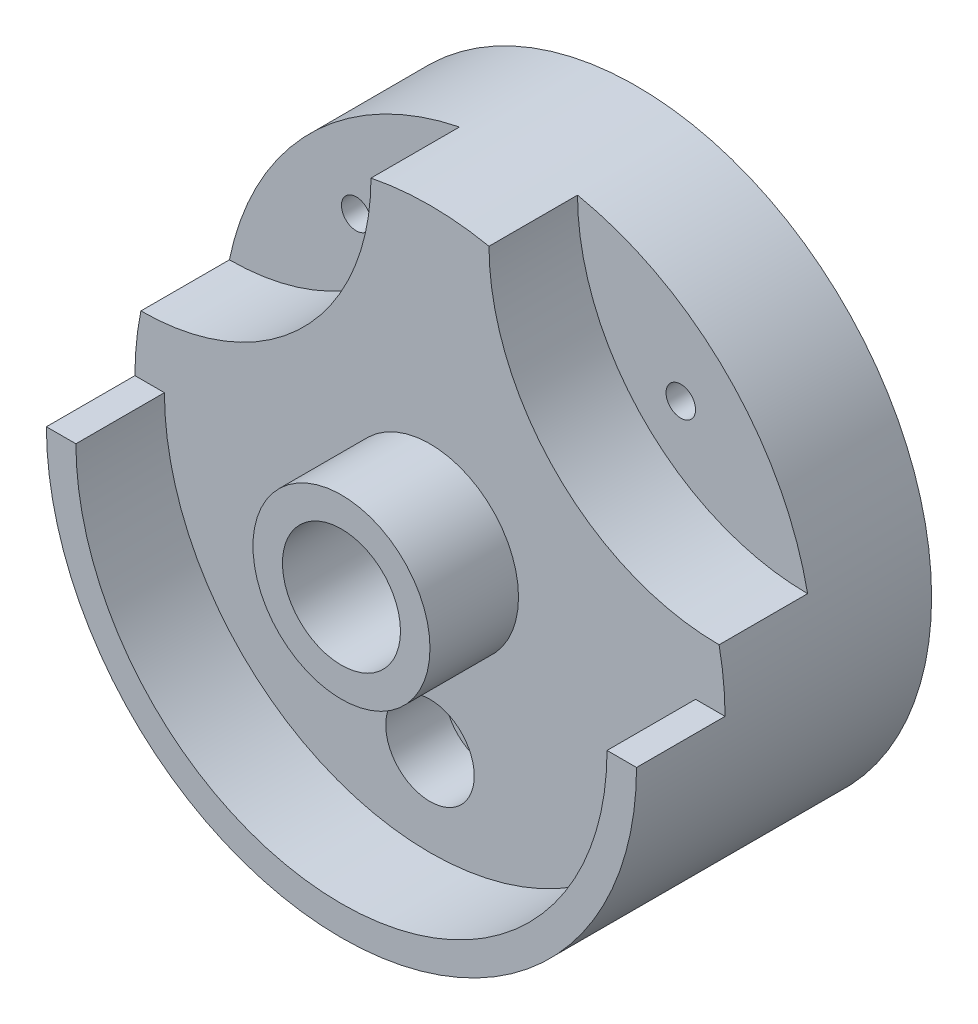
ISO-10303-21;
HEADER;
FILE_DESCRIPTION(('STEP AP214'),'2;1');
FILE_NAME('part.step','',(''),(''),'','','');
FILE_SCHEMA(('AUTOMOTIVE_DESIGN { 1 0 10303 214 1 1 1 1 }'));
ENDSEC;
DATA;
#1=APPLICATION_CONTEXT('core data for automotive mechanical design processes');
#2=APPLICATION_PROTOCOL_DEFINITION('international standard','automotive_design',2000,#1);
#3=PRODUCT_CONTEXT('',#1,'mechanical');
#4=PRODUCT('Part','Part','',(#3));
#5=PRODUCT_RELATED_PRODUCT_CATEGORY('part','',(#4));
#6=PRODUCT_DEFINITION_FORMATION('','',#4);
#7=PRODUCT_DEFINITION_CONTEXT('part definition',#1,'design');
#8=PRODUCT_DEFINITION('design','',#6,#7);
#9=PRODUCT_DEFINITION_SHAPE('','',#8);
#10=(LENGTH_UNIT() NAMED_UNIT(*) SI_UNIT(.MILLI.,.METRE.));
#11=(NAMED_UNIT(*) PLANE_ANGLE_UNIT() SI_UNIT($,.RADIAN.));
#12=(NAMED_UNIT(*) SI_UNIT($,.STERADIAN.) SOLID_ANGLE_UNIT());
#13=UNCERTAINTY_MEASURE_WITH_UNIT(LENGTH_MEASURE(1.E-05),#10,'distance_accuracy_value','');
#14=(GEOMETRIC_REPRESENTATION_CONTEXT(3) GLOBAL_UNCERTAINTY_ASSIGNED_CONTEXT((#13)) GLOBAL_UNIT_ASSIGNED_CONTEXT((#10,
#11,#12)) REPRESENTATION_CONTEXT('',''));
#15=CARTESIAN_POINT('',(0.,0.,0.));
#16=DIRECTION('',(0.,0.,1.));
#17=DIRECTION('',(1.,0.,0.));
#18=AXIS2_PLACEMENT_3D('',#15,#16,#17);
#19=CARTESIAN_POINT('',(0.,-30.,-65.));
#20=DIRECTION('',(0.,0.,1.));
#21=DIRECTION('',(1.,0.,0.));
#22=AXIS2_PLACEMENT_3D('',#19,#20,#21);
#23=CYLINDRICAL_SURFACE('',#22,2.5);
#24=CARTESIAN_POINT('',(0.,-30.,25.));
#25=DIRECTION('',(0.,0.,1.));
#26=DIRECTION('',(1.,0.,0.));
#27=AXIS2_PLACEMENT_3D('',#24,#25,#26);
#28=CIRCLE('',#27,2.5);
#29=CARTESIAN_POINT('',(2.5,-30.,25.));
#30=VERTEX_POINT('',#29);
#31=EDGE_CURVE('E403',#30,#30,#28,.T.);
#32=ORIENTED_EDGE('',*,*,#31,.T.);
#33=EDGE_LOOP('',(#32));
#34=FACE_BOUND('',#33,.T.);
#35=CARTESIAN_POINT('',(0.,-30.,9.99999999999999));
#36=DIRECTION('',(0.,0.,-1.));
#37=DIRECTION('',(-1.,0.,0.));
#38=AXIS2_PLACEMENT_3D('',#35,#36,#37);
#39=CIRCLE('',#38,2.5);
#40=CARTESIAN_POINT('',(-2.5,-30.,9.99999999999999));
#41=VERTEX_POINT('',#40);
#42=EDGE_CURVE('E37',#41,#41,#39,.F.);
#43=ORIENTED_EDGE('',*,*,#42,.F.);
#44=EDGE_LOOP('',(#43));
#45=FACE_BOUND('',#44,.T.);
#46=ADVANCED_FACE('F33',(#34,#45),#23,.F.);
#47=CARTESIAN_POINT('',(0.,0.,20.));
#48=DIRECTION('',(0.,0.,1.));
#49=DIRECTION('',(1.,0.,0.));
#50=AXIS2_PLACEMENT_3D('',#47,#48,#49);
#51=PLANE('',#50);
#52=CARTESIAN_POINT('',(27.5,27.5,20.));
#53=DIRECTION('',(0.,0.,1.));
#54=DIRECTION('',(1.,0.,0.));
#55=AXIS2_PLACEMENT_3D('',#52,#53,#54);
#56=CIRCLE('',#55,2.5);
#57=CARTESIAN_POINT('',(30.,27.5,20.));
#58=VERTEX_POINT('',#57);
#59=EDGE_CURVE('E410',#58,#58,#56,.T.);
#60=ORIENTED_EDGE('',*,*,#59,.F.);
#61=EDGE_LOOP('',(#60));
#62=FACE_BOUND('',#61,.T.);
#63=CARTESIAN_POINT('',(48.9897948556636,48.9897948556636,20.));
#64=DIRECTION('',(0.,0.,1.));
#65=DIRECTION('',(1.,0.,0.));
#66=AXIS2_PLACEMENT_3D('',#63,#64,#65);
#67=CIRCLE('',#66,38.9897948556636);
#68=CARTESIAN_POINT('',(10.,48.9897948556636,20.));
#69=VERTEX_POINT('',#68);
#70=CARTESIAN_POINT('',(48.9897948556636,10.,20.));
#71=VERTEX_POINT('',#70);
#72=EDGE_CURVE('E108',#69,#71,#67,.T.);
#73=ORIENTED_EDGE('',*,*,#72,.T.);
#74=CARTESIAN_POINT('',(0.,0.,20.));
#75=DIRECTION('',(0.,0.,1.));
#76=DIRECTION('',(1.,0.,0.));
#77=AXIS2_PLACEMENT_3D('',#74,#75,#76);
#78=CIRCLE('',#77,50.);
#79=EDGE_CURVE('E11',#71,#69,#78,.T.);
#80=ORIENTED_EDGE('',*,*,#79,.T.);
#81=EDGE_LOOP('',(#73,#80));
#82=FACE_BOUND('',#81,.T.);
#83=ADVANCED_FACE('F190',(#62,#82),#51,.T.);
#84=CARTESIAN_POINT('',(0.,0.,20.));
#85=DIRECTION('',(0.,0.,-1.));
#86=DIRECTION('',(-1.,0.,0.));
#87=AXIS2_PLACEMENT_3D('',#84,#85,#86);
#88=CYLINDRICAL_SURFACE('',#87,50.);
#89=ORIENTED_EDGE('',*,*,#79,.F.);
#90=DIRECTION('',(0.,0.,-1.));
#91=VECTOR('',#90,1.);
#92=CARTESIAN_POINT('',(48.9897948556636,10.,35.));
#93=LINE('',#92,#91);
#94=CARTESIAN_POINT('',(48.9897948556636,10.,35.));
#95=VERTEX_POINT('',#94);
#96=EDGE_CURVE('E142',#95,#71,#93,.T.);
#97=ORIENTED_EDGE('',*,*,#96,.F.);
#98=CARTESIAN_POINT('',(0.,0.,35.));
#99=DIRECTION('',(0.,0.,1.));
#100=DIRECTION('',(1.,0.,0.));
#101=AXIS2_PLACEMENT_3D('',#98,#99,#100);
#102=CIRCLE('',#101,50.);
#103=CARTESIAN_POINT('',(50.,0.,35.));
#104=VERTEX_POINT('',#103);
#105=EDGE_CURVE('E121',#104,#95,#102,.T.);
#106=ORIENTED_EDGE('',*,*,#105,.F.);
#107=DIRECTION('',(0.,0.,-1.));
#108=VECTOR('',#107,1.);
#109=CARTESIAN_POINT('',(50.,0.,50.));
#110=LINE('',#109,#108);
#111=CARTESIAN_POINT('',(50.,0.,50.));
#112=VERTEX_POINT('',#111);
#113=EDGE_CURVE('E160',#112,#104,#110,.T.);
#114=ORIENTED_EDGE('',*,*,#113,.F.);
#115=CARTESIAN_POINT('',(0.,0.,50.));
#116=DIRECTION('',(0.,0.,1.));
#117=DIRECTION('',(1.,0.,0.));
#118=AXIS2_PLACEMENT_3D('',#115,#116,#117);
#119=CIRCLE('',#118,50.);
#120=CARTESIAN_POINT('',(-50.,0.,50.));
#121=VERTEX_POINT('',#120);
#122=EDGE_CURVE('E111',#121,#112,#119,.T.);
#123=ORIENTED_EDGE('',*,*,#122,.F.);
#124=DIRECTION('',(0.,0.,-1.));
#125=VECTOR('',#124,1.);
#126=CARTESIAN_POINT('',(-50.,0.,50.));
#127=LINE('',#126,#125);
#128=CARTESIAN_POINT('',(-50.,0.,35.));
#129=VERTEX_POINT('',#128);
#130=EDGE_CURVE('E153',#121,#129,#127,.T.);
#131=ORIENTED_EDGE('',*,*,#130,.T.);
#132=CARTESIAN_POINT('',(-48.9897948556636,9.99999999999999,35.));
#133=VERTEX_POINT('',#132);
#134=EDGE_CURVE('E50',#133,#129,#102,.T.);
#135=ORIENTED_EDGE('',*,*,#134,.F.);
#136=DIRECTION('',(0.,0.,-1.));
#137=VECTOR('',#136,1.);
#138=CARTESIAN_POINT('',(-48.9897948556636,9.99999999999999,35.));
#139=LINE('',#138,#137);
#140=CARTESIAN_POINT('',(-48.9897948556636,9.99999999999999,20.));
#141=VERTEX_POINT('',#140);
#142=EDGE_CURVE('E144',#133,#141,#139,.T.);
#143=ORIENTED_EDGE('',*,*,#142,.T.);
#144=CARTESIAN_POINT('',(-10.,48.9897948556636,20.));
#145=VERTEX_POINT('',#144);
#146=EDGE_CURVE('E42',#145,#141,#78,.T.);
#147=ORIENTED_EDGE('',*,*,#146,.F.);
#148=DIRECTION('',(0.,0.,-1.));
#149=VECTOR('',#148,1.);
#150=CARTESIAN_POINT('',(-10.,48.9897948556636,35.));
#151=LINE('',#150,#149);
#152=CARTESIAN_POINT('',(-10.,48.9897948556636,35.));
#153=VERTEX_POINT('',#152);
#154=EDGE_CURVE('E112',#153,#145,#151,.T.);
#155=ORIENTED_EDGE('',*,*,#154,.F.);
#156=CARTESIAN_POINT('',(10.,48.9897948556636,35.));
#157=VERTEX_POINT('',#156);
#158=EDGE_CURVE('E115',#157,#153,#102,.T.);
#159=ORIENTED_EDGE('',*,*,#158,.F.);
#160=DIRECTION('',(0.,0.,-1.));
#161=VECTOR('',#160,1.);
#162=CARTESIAN_POINT('',(10.,48.9897948556636,35.));
#163=LINE('',#162,#161);
#164=EDGE_CURVE('E102',#157,#69,#163,.T.);
#165=ORIENTED_EDGE('',*,*,#164,.T.);
#166=EDGE_LOOP('',(#89,#97,#106,#114,#123,#131,#135,#143,#147,#155,#159,#165));
#167=FACE_BOUND('',#166,.T.);
#168=CARTESIAN_POINT('',(0.,0.,0.));
#169=DIRECTION('',(0.,0.,1.));
#170=DIRECTION('',(1.,0.,0.));
#171=AXIS2_PLACEMENT_3D('',#168,#169,#170);
#172=CIRCLE('',#171,50.);
#173=CARTESIAN_POINT('',(50.,0.,0.));
#174=VERTEX_POINT('',#173);
#175=EDGE_CURVE('E161',#174,#174,#172,.T.);
#176=ORIENTED_EDGE('',*,*,#175,.T.);
#177=EDGE_LOOP('',(#176));
#178=FACE_BOUND('',#177,.T.);
#179=ADVANCED_FACE('F35',(#167,#178),#88,.T.);
#180=CARTESIAN_POINT('',(-27.5,27.5,20.));
#181=DIRECTION('',(0.,0.,1.));
#182=DIRECTION('',(1.,0.,0.));
#183=AXIS2_PLACEMENT_3D('',#180,#181,#182);
#184=CIRCLE('',#183,2.5);
#185=CARTESIAN_POINT('',(-25.,27.5,20.));
#186=VERTEX_POINT('',#185);
#187=EDGE_CURVE('E130',#186,#186,#184,.T.);
#188=ORIENTED_EDGE('',*,*,#187,.F.);
#189=EDGE_LOOP('',(#188));
#190=FACE_BOUND('',#189,.T.);
#191=CARTESIAN_POINT('',(-48.9897948556636,48.9897948556636,20.));
#192=DIRECTION('',(0.,0.,1.));
#193=DIRECTION('',(1.,0.,0.));
#194=AXIS2_PLACEMENT_3D('',#191,#192,#193);
#195=CIRCLE('',#194,38.9897948556636);
#196=EDGE_CURVE('E125',#141,#145,#195,.T.);
#197=ORIENTED_EDGE('',*,*,#196,.T.);
#198=ORIENTED_EDGE('',*,*,#146,.T.);
#199=EDGE_LOOP('',(#197,#198));
#200=FACE_BOUND('',#199,.T.);
#201=ADVANCED_FACE('F194',(#190,#200),#51,.T.);
#202=CARTESIAN_POINT('',(0.,0.,0.));
#203=DIRECTION('',(0.,0.,1.));
#204=DIRECTION('',(1.,0.,0.));
#205=AXIS2_PLACEMENT_3D('',#202,#203,#204);
#206=PLANE('',#205);
#207=CARTESIAN_POINT('',(0.,0.,0.));
#208=DIRECTION('',(0.,0.,1.));
#209=DIRECTION('',(1.,0.,0.));
#210=AXIS2_PLACEMENT_3D('',#207,#208,#209);
#211=CIRCLE('',#210,10.);
#212=CARTESIAN_POINT('',(10.,0.,0.));
#213=VERTEX_POINT('',#212);
#214=EDGE_CURVE('E387',#213,#213,#211,.T.);
#215=ORIENTED_EDGE('',*,*,#214,.T.);
#216=EDGE_LOOP('',(#215));
#217=FACE_BOUND('',#216,.T.);
#218=CARTESIAN_POINT('',(0.,-30.,0.));
#219=DIRECTION('',(0.,0.,-1.));
#220=DIRECTION('',(-1.,0.,0.));
#221=AXIS2_PLACEMENT_3D('',#218,#219,#220);
#222=CIRCLE('',#221,12.5);
#223=CARTESIAN_POINT('',(-12.5,-30.,0.));
#224=VERTEX_POINT('',#223);
#225=EDGE_CURVE('E396',#224,#224,#222,.T.);
#226=ORIENTED_EDGE('',*,*,#225,.F.);
#227=EDGE_LOOP('',(#226));
#228=FACE_BOUND('',#227,.T.);
#229=CARTESIAN_POINT('',(27.5,27.5,0.));
#230=DIRECTION('',(0.,0.,1.));
#231=DIRECTION('',(1.,0.,0.));
#232=AXIS2_PLACEMENT_3D('',#229,#230,#231);
#233=CIRCLE('',#232,2.5);
#234=CARTESIAN_POINT('',(30.,27.5,0.));
#235=VERTEX_POINT('',#234);
#236=EDGE_CURVE('E413',#235,#235,#233,.T.);
#237=ORIENTED_EDGE('',*,*,#236,.T.);
#238=EDGE_LOOP('',(#237));
#239=FACE_BOUND('',#238,.T.);
#240=CARTESIAN_POINT('',(-27.5,27.5,0.));
#241=DIRECTION('',(0.,0.,1.));
#242=DIRECTION('',(1.,0.,0.));
#243=AXIS2_PLACEMENT_3D('',#240,#241,#242);
#244=CIRCLE('',#243,2.5);
#245=CARTESIAN_POINT('',(-25.,27.5,0.));
#246=VERTEX_POINT('',#245);
#247=EDGE_CURVE('E140',#246,#246,#244,.T.);
#248=ORIENTED_EDGE('',*,*,#247,.T.);
#249=EDGE_LOOP('',(#248));
#250=FACE_BOUND('',#249,.T.);
#251=ORIENTED_EDGE('',*,*,#175,.F.);
#252=EDGE_LOOP('',(#251));
#253=FACE_BOUND('',#252,.T.);
#254=ADVANCED_FACE('F204',(#217,#228,#239,#250,#253),#206,.F.);
#255=CARTESIAN_POINT('',(45.,0.,50.));
#256=DIRECTION('',(0.,-1.,0.));
#257=DIRECTION('',(1.,0.,0.));
#258=AXIS2_PLACEMENT_3D('',#255,#256,#257);
#259=PLANE('',#258);
#260=ORIENTED_EDGE('',*,*,#113,.T.);
#261=DIRECTION('',(1.,0.,0.));
#262=VECTOR('',#261,1.);
#263=CARTESIAN_POINT('',(0.,-1.63931368479808E-13,35.));
#264=LINE('',#263,#262);
#265=CARTESIAN_POINT('',(45.,0.,35.));
#266=VERTEX_POINT('',#265);
#267=EDGE_CURVE('E138',#266,#104,#264,.T.);
#268=ORIENTED_EDGE('',*,*,#267,.F.);
#269=DIRECTION('',(0.,0.,-1.));
#270=VECTOR('',#269,1.);
#271=CARTESIAN_POINT('',(45.,0.,50.));
#272=LINE('',#271,#270);
#273=CARTESIAN_POINT('',(45.,0.,50.));
#274=VERTEX_POINT('',#273);
#275=EDGE_CURVE('E157',#274,#266,#272,.T.);
#276=ORIENTED_EDGE('',*,*,#275,.F.);
#277=DIRECTION('',(-1.,0.,0.));
#278=VECTOR('',#277,1.);
#279=CARTESIAN_POINT('',(45.,0.,50.));
#280=LINE('',#279,#278);
#281=EDGE_CURVE('E148',#112,#274,#280,.T.);
#282=ORIENTED_EDGE('',*,*,#281,.F.);
#283=EDGE_LOOP('',(#260,#268,#276,#282));
#284=FACE_BOUND('',#283,.T.);
#285=ADVANCED_FACE('F188',(#284),#259,.F.);
#286=CARTESIAN_POINT('',(0.,0.,50.));
#287=DIRECTION('',(0.,0.,-1.));
#288=DIRECTION('',(-1.,0.,0.));
#289=AXIS2_PLACEMENT_3D('',#286,#287,#288);
#290=CYLINDRICAL_SURFACE('',#289,45.);
#291=ORIENTED_EDGE('',*,*,#275,.T.);
#292=CARTESIAN_POINT('',(0.,0.,35.));
#293=DIRECTION('',(0.,0.,1.));
#294=DIRECTION('',(1.,0.,0.));
#295=AXIS2_PLACEMENT_3D('',#292,#293,#294);
#296=CIRCLE('',#295,45.);
#297=CARTESIAN_POINT('',(-45.,0.,35.));
#298=VERTEX_POINT('',#297);
#299=EDGE_CURVE('E136',#298,#266,#296,.T.);
#300=ORIENTED_EDGE('',*,*,#299,.F.);
#301=DIRECTION('',(0.,0.,-1.));
#302=VECTOR('',#301,1.);
#303=CARTESIAN_POINT('',(-45.,0.,50.));
#304=LINE('',#303,#302);
#305=CARTESIAN_POINT('',(-45.,0.,50.));
#306=VERTEX_POINT('',#305);
#307=EDGE_CURVE('E154',#306,#298,#304,.T.);
#308=ORIENTED_EDGE('',*,*,#307,.F.);
#309=CARTESIAN_POINT('',(0.,0.,50.));
#310=DIRECTION('',(0.,0.,-1.));
#311=DIRECTION('',(1.,0.,0.));
#312=AXIS2_PLACEMENT_3D('',#309,#310,#311);
#313=CIRCLE('',#312,45.);
#314=EDGE_CURVE('E150',#274,#306,#313,.T.);
#315=ORIENTED_EDGE('',*,*,#314,.F.);
#316=EDGE_LOOP('',(#291,#300,#308,#315));
#317=FACE_BOUND('',#316,.T.);
#318=ADVANCED_FACE('F183',(#317),#290,.F.);
#319=CARTESIAN_POINT('',(-50.,0.,50.));
#320=DIRECTION('',(0.,-1.,0.));
#321=DIRECTION('',(0.,0.,-1.));
#322=AXIS2_PLACEMENT_3D('',#319,#320,#321);
#323=PLANE('',#322);
#324=ORIENTED_EDGE('',*,*,#307,.T.);
#325=DIRECTION('',(1.,0.,0.));
#326=VECTOR('',#325,1.);
#327=CARTESIAN_POINT('',(0.,0.,35.));
#328=LINE('',#327,#326);
#329=EDGE_CURVE('E134',#129,#298,#328,.T.);
#330=ORIENTED_EDGE('',*,*,#329,.F.);
#331=ORIENTED_EDGE('',*,*,#130,.F.);
#332=DIRECTION('',(-1.,0.,0.));
#333=VECTOR('',#332,1.);
#334=CARTESIAN_POINT('',(-50.,0.,50.));
#335=LINE('',#334,#333);
#336=EDGE_CURVE('E58',#306,#121,#335,.T.);
#337=ORIENTED_EDGE('',*,*,#336,.F.);
#338=EDGE_LOOP('',(#324,#330,#331,#337));
#339=FACE_BOUND('',#338,.T.);
#340=ADVANCED_FACE('F178',(#339),#323,.F.);
#341=CARTESIAN_POINT('',(0.,0.,50.));
#342=DIRECTION('',(0.,0.,1.));
#343=DIRECTION('',(1.,0.,0.));
#344=AXIS2_PLACEMENT_3D('',#341,#342,#343);
#345=PLANE('',#344);
#346=ORIENTED_EDGE('',*,*,#122,.T.);
#347=ORIENTED_EDGE('',*,*,#281,.T.);
#348=ORIENTED_EDGE('',*,*,#314,.T.);
#349=ORIENTED_EDGE('',*,*,#336,.T.);
#350=EDGE_LOOP('',(#346,#347,#348,#349));
#351=FACE_BOUND('',#350,.T.);
#352=ADVANCED_FACE('F226',(#351),#345,.T.);
#353=CARTESIAN_POINT('',(48.9897948556636,48.9897948556636,35.));
#354=DIRECTION('',(0.,0.,-1.));
#355=DIRECTION('',(-1.,0.,0.));
#356=AXIS2_PLACEMENT_3D('',#353,#354,#355);
#357=CYLINDRICAL_SURFACE('',#356,38.9897948556636);
#358=ORIENTED_EDGE('',*,*,#72,.F.);
#359=ORIENTED_EDGE('',*,*,#164,.F.);
#360=CARTESIAN_POINT('',(48.9897948556636,48.9897948556636,35.));
#361=DIRECTION('',(0.,0.,1.));
#362=DIRECTION('',(1.,0.,0.));
#363=AXIS2_PLACEMENT_3D('',#360,#361,#362);
#364=CIRCLE('',#363,38.9897948556636);
#365=EDGE_CURVE('E106',#157,#95,#364,.T.);
#366=ORIENTED_EDGE('',*,*,#365,.T.);
#367=ORIENTED_EDGE('',*,*,#96,.T.);
#368=EDGE_LOOP('',(#358,#359,#366,#367));
#369=FACE_BOUND('',#368,.T.);
#370=ADVANCED_FACE('F104',(#369),#357,.F.);
#371=CARTESIAN_POINT('',(-48.9897948556636,48.9897948556636,35.));
#372=DIRECTION('',(0.,0.,-1.));
#373=DIRECTION('',(-1.,0.,0.));
#374=AXIS2_PLACEMENT_3D('',#371,#372,#373);
#375=CYLINDRICAL_SURFACE('',#374,38.9897948556636);
#376=ORIENTED_EDGE('',*,*,#196,.F.);
#377=ORIENTED_EDGE('',*,*,#142,.F.);
#378=CARTESIAN_POINT('',(-48.9897948556636,48.9897948556636,35.));
#379=DIRECTION('',(0.,0.,1.));
#380=DIRECTION('',(1.,0.,0.));
#381=AXIS2_PLACEMENT_3D('',#378,#379,#380);
#382=CIRCLE('',#381,38.9897948556636);
#383=EDGE_CURVE('E119',#133,#153,#382,.T.);
#384=ORIENTED_EDGE('',*,*,#383,.T.);
#385=ORIENTED_EDGE('',*,*,#154,.T.);
#386=EDGE_LOOP('',(#376,#377,#384,#385));
#387=FACE_BOUND('',#386,.T.);
#388=ADVANCED_FACE('F216',(#387),#375,.F.);
#389=CARTESIAN_POINT('',(0.,0.,35.));
#390=DIRECTION('',(0.,0.,1.));
#391=DIRECTION('',(1.,0.,0.));
#392=AXIS2_PLACEMENT_3D('',#389,#390,#391);
#393=PLANE('',#392);
#394=CARTESIAN_POINT('',(0.,0.,35.));
#395=DIRECTION('',(0.,0.,1.));
#396=DIRECTION('',(1.,0.,0.));
#397=AXIS2_PLACEMENT_3D('',#394,#395,#396);
#398=CIRCLE('',#397,15.);
#399=CARTESIAN_POINT('',(15.,0.,35.));
#400=VERTEX_POINT('',#399);
#401=EDGE_CURVE('E388',#400,#400,#398,.T.);
#402=ORIENTED_EDGE('',*,*,#401,.F.);
#403=EDGE_LOOP('',(#402));
#404=FACE_BOUND('',#403,.T.);
#405=CARTESIAN_POINT('',(0.,-30.,35.));
#406=DIRECTION('',(0.,0.,1.));
#407=DIRECTION('',(1.,0.,0.));
#408=AXIS2_PLACEMENT_3D('',#405,#406,#407);
#409=CIRCLE('',#408,7.5);
#410=CARTESIAN_POINT('',(7.5,-30.,35.));
#411=VERTEX_POINT('',#410);
#412=EDGE_CURVE('E406',#411,#411,#409,.T.);
#413=ORIENTED_EDGE('',*,*,#412,.F.);
#414=EDGE_LOOP('',(#413));
#415=FACE_BOUND('',#414,.T.);
#416=ORIENTED_EDGE('',*,*,#365,.F.);
#417=ORIENTED_EDGE('',*,*,#158,.T.);
#418=ORIENTED_EDGE('',*,*,#383,.F.);
#419=ORIENTED_EDGE('',*,*,#134,.T.);
#420=ORIENTED_EDGE('',*,*,#329,.T.);
#421=ORIENTED_EDGE('',*,*,#299,.T.);
#422=ORIENTED_EDGE('',*,*,#267,.T.);
#423=ORIENTED_EDGE('',*,*,#105,.T.);
#424=EDGE_LOOP('',(#416,#417,#418,#419,#420,#421,#422,#423));
#425=FACE_BOUND('',#424,.T.);
#426=ADVANCED_FACE('F122',(#404,#415,#425),#393,.T.);
#427=CARTESIAN_POINT('',(-27.5,27.5,-23.));
#428=DIRECTION('',(0.,0.,1.));
#429=DIRECTION('',(1.,0.,0.));
#430=AXIS2_PLACEMENT_3D('',#427,#428,#429);
#431=CYLINDRICAL_SURFACE('',#430,2.5);
#432=ORIENTED_EDGE('',*,*,#187,.T.);
#433=EDGE_LOOP('',(#432));
#434=FACE_BOUND('',#433,.T.);
#435=ORIENTED_EDGE('',*,*,#247,.F.);
#436=EDGE_LOOP('',(#435));
#437=FACE_BOUND('',#436,.T.);
#438=ADVANCED_FACE('F223',(#434,#437),#431,.F.);
#439=CARTESIAN_POINT('',(27.5,27.5,-23.));
#440=DIRECTION('',(0.,0.,1.));
#441=DIRECTION('',(1.,0.,0.));
#442=AXIS2_PLACEMENT_3D('',#439,#440,#441);
#443=CYLINDRICAL_SURFACE('',#442,2.5);
#444=ORIENTED_EDGE('',*,*,#59,.T.);
#445=EDGE_LOOP('',(#444));
#446=FACE_BOUND('',#445,.T.);
#447=ORIENTED_EDGE('',*,*,#236,.F.);
#448=EDGE_LOOP('',(#447));
#449=FACE_BOUND('',#448,.T.);
#450=ADVANCED_FACE('F283',(#446,#449),#443,.F.);
#451=CARTESIAN_POINT('',(0.,-30.,25.));
#452=DIRECTION('',(0.,0.,1.));
#453=DIRECTION('',(1.,0.,0.));
#454=AXIS2_PLACEMENT_3D('',#451,#452,#453);
#455=CYLINDRICAL_SURFACE('',#454,7.5);
#456=CARTESIAN_POINT('',(0.,-30.,25.));
#457=DIRECTION('',(0.,0.,1.));
#458=DIRECTION('',(1.,0.,0.));
#459=AXIS2_PLACEMENT_3D('',#456,#457,#458);
#460=CIRCLE('',#459,7.5);
#461=CARTESIAN_POINT('',(7.5,-30.,25.));
#462=VERTEX_POINT('',#461);
#463=EDGE_CURVE('E407',#462,#462,#460,.T.);
#464=ORIENTED_EDGE('',*,*,#463,.F.);
#465=EDGE_LOOP('',(#464));
#466=FACE_BOUND('',#465,.T.);
#467=ORIENTED_EDGE('',*,*,#412,.T.);
#468=EDGE_LOOP('',(#467));
#469=FACE_BOUND('',#468,.T.);
#470=ADVANCED_FACE('F292',(#466,#469),#455,.F.);
#471=CARTESIAN_POINT('',(0.,-30.,25.));
#472=DIRECTION('',(0.,0.,1.));
#473=DIRECTION('',(1.,0.,0.));
#474=AXIS2_PLACEMENT_3D('',#471,#472,#473);
#475=PLANE('',#474);
#476=ORIENTED_EDGE('',*,*,#31,.F.);
#477=EDGE_LOOP('',(#476));
#478=FACE_BOUND('',#477,.T.);
#479=ORIENTED_EDGE('',*,*,#463,.T.);
#480=EDGE_LOOP('',(#479));
#481=FACE_BOUND('',#480,.T.);
#482=ADVANCED_FACE('F302',(#478,#481),#475,.T.);
#483=CARTESIAN_POINT('',(0.,-30.,10.));
#484=DIRECTION('',(0.,0.,-1.));
#485=DIRECTION('',(-1.,0.,0.));
#486=AXIS2_PLACEMENT_3D('',#483,#484,#485);
#487=PLANE('',#486);
#488=CARTESIAN_POINT('',(0.,-30.,10.));
#489=DIRECTION('',(0.,0.,-1.));
#490=DIRECTION('',(-1.,0.,0.));
#491=AXIS2_PLACEMENT_3D('',#488,#489,#490);
#492=CIRCLE('',#491,12.5);
#493=CARTESIAN_POINT('',(-12.5,-30.,10.));
#494=VERTEX_POINT('',#493);
#495=EDGE_CURVE('E398',#494,#494,#492,.T.);
#496=ORIENTED_EDGE('',*,*,#495,.T.);
#497=EDGE_LOOP('',(#496));
#498=FACE_BOUND('',#497,.T.);
#499=ORIENTED_EDGE('',*,*,#42,.T.);
#500=EDGE_LOOP('',(#499));
#501=FACE_BOUND('',#500,.T.);
#502=ADVANCED_FACE('F312',(#498,#501),#487,.T.);
#503=CARTESIAN_POINT('',(0.,-30.,10.));
#504=DIRECTION('',(0.,0.,-1.));
#505=DIRECTION('',(-1.,0.,0.));
#506=AXIS2_PLACEMENT_3D('',#503,#504,#505);
#507=CYLINDRICAL_SURFACE('',#506,12.5);
#508=ORIENTED_EDGE('',*,*,#495,.F.);
#509=EDGE_LOOP('',(#508));
#510=FACE_BOUND('',#509,.T.);
#511=ORIENTED_EDGE('',*,*,#225,.T.);
#512=EDGE_LOOP('',(#511));
#513=FACE_BOUND('',#512,.T.);
#514=ADVANCED_FACE('F328',(#510,#513),#507,.F.);
#515=CARTESIAN_POINT('',(0.,0.,50.));
#516=DIRECTION('',(0.,0.,-1.));
#517=DIRECTION('',(-1.,0.,0.));
#518=AXIS2_PLACEMENT_3D('',#515,#516,#517);
#519=CYLINDRICAL_SURFACE('',#518,15.);
#520=CARTESIAN_POINT('',(0.,0.,50.));
#521=DIRECTION('',(0.,0.,1.));
#522=DIRECTION('',(1.,0.,0.));
#523=AXIS2_PLACEMENT_3D('',#520,#521,#522);
#524=CIRCLE('',#523,15.);
#525=CARTESIAN_POINT('',(15.,0.,50.));
#526=VERTEX_POINT('',#525);
#527=EDGE_CURVE('E391',#526,#526,#524,.T.);
#528=ORIENTED_EDGE('',*,*,#527,.F.);
#529=EDGE_LOOP('',(#528));
#530=FACE_BOUND('',#529,.T.);
#531=ORIENTED_EDGE('',*,*,#401,.T.);
#532=EDGE_LOOP('',(#531));
#533=FACE_BOUND('',#532,.T.);
#534=ADVANCED_FACE('F338',(#530,#533),#519,.T.);
#535=CARTESIAN_POINT('',(0.,0.,50.));
#536=DIRECTION('',(0.,0.,1.));
#537=DIRECTION('',(1.,0.,0.));
#538=AXIS2_PLACEMENT_3D('',#535,#536,#537);
#539=PLANE('',#538);
#540=CARTESIAN_POINT('',(0.,0.,50.));
#541=DIRECTION('',(0.,0.,1.));
#542=DIRECTION('',(1.,0.,0.));
#543=AXIS2_PLACEMENT_3D('',#540,#541,#542);
#544=CIRCLE('',#543,10.);
#545=CARTESIAN_POINT('',(10.,0.,50.));
#546=VERTEX_POINT('',#545);
#547=EDGE_CURVE('E384',#546,#546,#544,.T.);
#548=ORIENTED_EDGE('',*,*,#547,.F.);
#549=EDGE_LOOP('',(#548));
#550=FACE_BOUND('',#549,.T.);
#551=ORIENTED_EDGE('',*,*,#527,.T.);
#552=EDGE_LOOP('',(#551));
#553=FACE_BOUND('',#552,.T.);
#554=ADVANCED_FACE('F352',(#550,#553),#539,.T.);
#555=CARTESIAN_POINT('',(0.,0.,-55.));
#556=DIRECTION('',(0.,0.,1.));
#557=DIRECTION('',(1.,0.,0.));
#558=AXIS2_PLACEMENT_3D('',#555,#556,#557);
#559=CYLINDRICAL_SURFACE('',#558,10.);
#560=ORIENTED_EDGE('',*,*,#547,.T.);
#561=EDGE_LOOP('',(#560));
#562=FACE_BOUND('',#561,.T.);
#563=ORIENTED_EDGE('',*,*,#214,.F.);
#564=EDGE_LOOP('',(#563));
#565=FACE_BOUND('',#564,.T.);
#566=ADVANCED_FACE('F367',(#562,#565),#559,.F.);
#567=CLOSED_SHELL('',(#46,#83,#179,#201,#254,#285,#318,#340,#352,#370,#388,#426,#438,#450,#470,
#482,#502,#514,#534,#554,#566));
#568=MANIFOLD_SOLID_BREP('B2',#567);
#569=ADVANCED_BREP_SHAPE_REPRESENTATION('',(#18,#568),#14);
#570=SHAPE_DEFINITION_REPRESENTATION(#9,#569);
ENDSEC;
END-ISO-10303-21;
